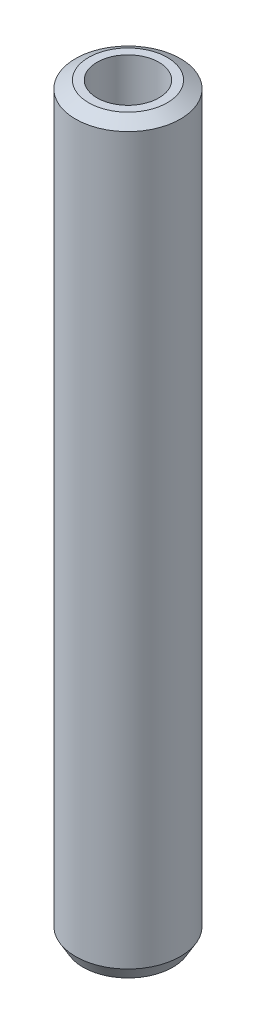
ISO-10303-21;
HEADER;
FILE_DESCRIPTION(('STEP AP214'),'2;1');
FILE_NAME('part.step','',(''),(''),'','','');
FILE_SCHEMA(('AUTOMOTIVE_DESIGN { 1 0 10303 214 1 1 1 1 }'));
ENDSEC;
DATA;
#1=APPLICATION_CONTEXT('core data for automotive mechanical design processes');
#2=APPLICATION_PROTOCOL_DEFINITION('international standard','automotive_design',2000,#1);
#3=PRODUCT_CONTEXT('',#1,'mechanical');
#4=PRODUCT('Part','Part','',(#3));
#5=PRODUCT_RELATED_PRODUCT_CATEGORY('part','',(#4));
#6=PRODUCT_DEFINITION_FORMATION('','',#4);
#7=PRODUCT_DEFINITION_CONTEXT('part definition',#1,'design');
#8=PRODUCT_DEFINITION('design','',#6,#7);
#9=PRODUCT_DEFINITION_SHAPE('','',#8);
#10=(LENGTH_UNIT() NAMED_UNIT(*) SI_UNIT(.MILLI.,.METRE.));
#11=(NAMED_UNIT(*) PLANE_ANGLE_UNIT() SI_UNIT($,.RADIAN.));
#12=(NAMED_UNIT(*) SI_UNIT($,.STERADIAN.) SOLID_ANGLE_UNIT());
#13=UNCERTAINTY_MEASURE_WITH_UNIT(LENGTH_MEASURE(1.E-05),#10,'distance_accuracy_value','');
#14=(GEOMETRIC_REPRESENTATION_CONTEXT(3) GLOBAL_UNCERTAINTY_ASSIGNED_CONTEXT((#13)) GLOBAL_UNIT_ASSIGNED_CONTEXT((#10,
#11,#12)) REPRESENTATION_CONTEXT('',''));
#15=CARTESIAN_POINT('',(0.,0.,0.));
#16=DIRECTION('',(0.,0.,1.));
#17=DIRECTION('',(1.,0.,0.));
#18=AXIS2_PLACEMENT_3D('',#15,#16,#17);
#19=CARTESIAN_POINT('',(0.,213.339934890492,0.));
#20=DIRECTION('',(0.,-1.,0.));
#21=DIRECTION('',(0.,0.,-1.));
#22=AXIS2_PLACEMENT_3D('',#19,#20,#21);
#23=CYLINDRICAL_SURFACE('',#22,15.);
#24=CARTESIAN_POINT('',(0.,211.173453034002,0.));
#25=DIRECTION('',(0.,1.,0.));
#26=DIRECTION('',(0.,0.,1.));
#27=AXIS2_PLACEMENT_3D('',#24,#25,#26);
#28=CIRCLE('',#27,15.);
#29=CARTESIAN_POINT('',(0.,211.173453034002,15.));
#30=VERTEX_POINT('',#29);
#31=EDGE_CURVE('E50',#30,#30,#28,.F.);
#32=ORIENTED_EDGE('',*,*,#31,.T.);
#33=EDGE_LOOP('',(#32));
#34=FACE_BOUND('',#33,.T.);
#35=CARTESIAN_POINT('',(0.,3.75245664911691,0.));
#36=DIRECTION('',(0.,1.,0.));
#37=DIRECTION('',(0.,0.,1.));
#38=AXIS2_PLACEMENT_3D('',#35,#36,#37);
#39=CIRCLE('',#38,15.);
#40=CARTESIAN_POINT('',(0.,3.75245664911691,15.));
#41=VERTEX_POINT('',#40);
#42=EDGE_CURVE('E51',#41,#41,#39,.T.);
#43=ORIENTED_EDGE('',*,*,#42,.T.);
#44=EDGE_LOOP('',(#43));
#45=FACE_BOUND('',#44,.T.);
#46=ADVANCED_FACE('F39',(#34,#45),#23,.T.);
#47=CARTESIAN_POINT('',(0.,213.339934890492,0.));
#48=DIRECTION('',(0.,1.,0.));
#49=DIRECTION('',(0.,0.,1.));
#50=AXIS2_PLACEMENT_3D('',#47,#48,#49);
#51=PLANE('',#50);
#52=CARTESIAN_POINT('',(0.,213.339934890492,0.));
#53=DIRECTION('',(0.,1.,0.));
#54=DIRECTION('',(0.,0.,1.));
#55=AXIS2_PLACEMENT_3D('',#52,#53,#54);
#56=CIRCLE('',#55,11.2475433508831);
#57=CARTESIAN_POINT('',(0.,213.339934890492,11.2475433508831));
#58=VERTEX_POINT('',#57);
#59=EDGE_CURVE('E54',#58,#58,#56,.T.);
#60=ORIENTED_EDGE('',*,*,#59,.T.);
#61=EDGE_LOOP('',(#60));
#62=FACE_BOUND('',#61,.T.);
#63=CARTESIAN_POINT('',(0.,213.339934890492,0.));
#64=DIRECTION('',(0.,1.,0.));
#65=DIRECTION('',(0.,0.,1.));
#66=AXIS2_PLACEMENT_3D('',#63,#64,#65);
#67=CIRCLE('',#66,8.84748581278893);
#68=CARTESIAN_POINT('',(0.,213.339934890492,8.84748581278893));
#69=VERTEX_POINT('',#68);
#70=EDGE_CURVE('E58',#69,#69,#67,.T.);
#71=ORIENTED_EDGE('',*,*,#70,.F.);
#72=EDGE_LOOP('',(#71));
#73=FACE_BOUND('',#72,.T.);
#74=ADVANCED_FACE('F69',(#62,#73),#51,.T.);
#75=CARTESIAN_POINT('',(0.,0.,0.));
#76=DIRECTION('',(0.,1.,0.));
#77=DIRECTION('',(0.,0.,1.));
#78=AXIS2_PLACEMENT_3D('',#75,#76,#77);
#79=PLANE('',#78);
#80=CARTESIAN_POINT('',(0.,0.,0.));
#81=DIRECTION('',(0.,1.,0.));
#82=DIRECTION('',(0.,0.,1.));
#83=AXIS2_PLACEMENT_3D('',#80,#81,#82);
#84=CIRCLE('',#83,12.8335181435099);
#85=CARTESIAN_POINT('',(0.,0.,12.8335181435099));
#86=VERTEX_POINT('',#85);
#87=EDGE_CURVE('E10',#86,#86,#84,.F.);
#88=ORIENTED_EDGE('',*,*,#87,.T.);
#89=EDGE_LOOP('',(#88));
#90=FACE_BOUND('',#89,.T.);
#91=CARTESIAN_POINT('',(0.,0.,0.));
#92=DIRECTION('',(0.,1.,0.));
#93=DIRECTION('',(0.,0.,1.));
#94=AXIS2_PLACEMENT_3D('',#91,#92,#93);
#95=CIRCLE('',#94,8.84748581278893);
#96=CARTESIAN_POINT('',(0.,0.,8.84748581278893));
#97=VERTEX_POINT('',#96);
#98=EDGE_CURVE('E63',#97,#97,#95,.T.);
#99=ORIENTED_EDGE('',*,*,#98,.T.);
#100=EDGE_LOOP('',(#99));
#101=FACE_BOUND('',#100,.T.);
#102=ADVANCED_FACE('F75',(#90,#101),#79,.F.);
#103=CARTESIAN_POINT('',(0.,213.339934890492,0.));
#104=DIRECTION('',(0.,-1.,0.));
#105=DIRECTION('',(0.,0.,-1.));
#106=AXIS2_PLACEMENT_3D('',#103,#104,#105);
#107=CYLINDRICAL_SURFACE('',#106,8.84748581278893);
#108=ORIENTED_EDGE('',*,*,#70,.T.);
#109=EDGE_LOOP('',(#108));
#110=FACE_BOUND('',#109,.T.);
#111=ORIENTED_EDGE('',*,*,#98,.F.);
#112=EDGE_LOOP('',(#111));
#113=FACE_BOUND('',#112,.T.);
#114=ADVANCED_FACE('F70',(#110,#113),#107,.F.);
#115=CARTESIAN_POINT('',(0.,213.339934890492,0.));
#116=DIRECTION('',(0.,-1.,0.));
#117=DIRECTION('',(0.,0.,-1.));
#118=AXIS2_PLACEMENT_3D('',#115,#116,#117);
#119=CONICAL_SURFACE('',#118,11.2475433508831,1.04719755119659);
#120=ORIENTED_EDGE('',*,*,#31,.F.);
#121=EDGE_LOOP('',(#120));
#122=FACE_BOUND('',#121,.T.);
#123=ORIENTED_EDGE('',*,*,#59,.F.);
#124=EDGE_LOOP('',(#123));
#125=FACE_BOUND('',#124,.T.);
#126=ADVANCED_FACE('F81',(#122,#125),#119,.T.);
#127=CARTESIAN_POINT('',(0.,3.75245664911691,0.));
#128=DIRECTION('',(0.,1.,0.));
#129=DIRECTION('',(0.,0.,1.));
#130=AXIS2_PLACEMENT_3D('',#127,#128,#129);
#131=CONICAL_SURFACE('',#130,15.,0.523598775598303);
#132=ORIENTED_EDGE('',*,*,#87,.F.);
#133=EDGE_LOOP('',(#132));
#134=FACE_BOUND('',#133,.T.);
#135=ORIENTED_EDGE('',*,*,#42,.F.);
#136=EDGE_LOOP('',(#135));
#137=FACE_BOUND('',#136,.T.);
#138=ADVANCED_FACE('F45',(#134,#137),#131,.T.);
#139=CLOSED_SHELL('',(#46,#74,#102,#114,#126,#138));
#140=MANIFOLD_SOLID_BREP('B2',#139);
#141=ADVANCED_BREP_SHAPE_REPRESENTATION('',(#18,#140),#14);
#142=SHAPE_DEFINITION_REPRESENTATION(#9,#141);
ENDSEC;
END-ISO-10303-21;
